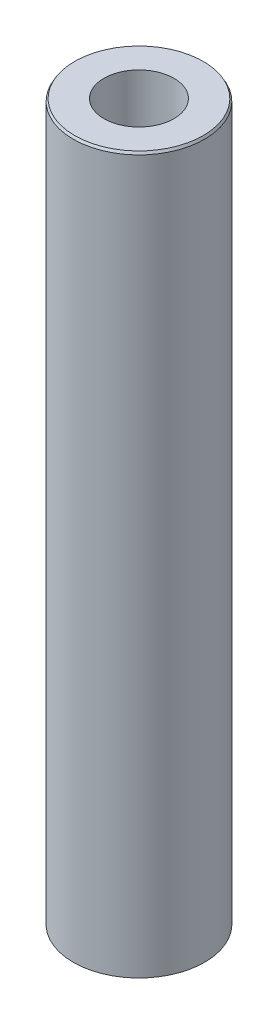
ISO-10303-21;
HEADER;
FILE_DESCRIPTION(('STEP AP214'),'2;1');
FILE_NAME('part.step','',(''),(''),'','','');
FILE_SCHEMA(('AUTOMOTIVE_DESIGN { 1 0 10303 214 1 1 1 1 }'));
ENDSEC;
DATA;
#1=APPLICATION_CONTEXT('core data for automotive mechanical design processes');
#2=APPLICATION_PROTOCOL_DEFINITION('international standard','automotive_design',2000,#1);
#3=PRODUCT_CONTEXT('',#1,'mechanical');
#4=PRODUCT('Part','Part','',(#3));
#5=PRODUCT_RELATED_PRODUCT_CATEGORY('part','',(#4));
#6=PRODUCT_DEFINITION_FORMATION('','',#4);
#7=PRODUCT_DEFINITION_CONTEXT('part definition',#1,'design');
#8=PRODUCT_DEFINITION('design','',#6,#7);
#9=PRODUCT_DEFINITION_SHAPE('','',#8);
#10=(LENGTH_UNIT() NAMED_UNIT(*) SI_UNIT(.MILLI.,.METRE.));
#11=(NAMED_UNIT(*) PLANE_ANGLE_UNIT() SI_UNIT($,.RADIAN.));
#12=(NAMED_UNIT(*) SI_UNIT($,.STERADIAN.) SOLID_ANGLE_UNIT());
#13=UNCERTAINTY_MEASURE_WITH_UNIT(LENGTH_MEASURE(1.E-05),#10,'distance_accuracy_value','');
#14=(GEOMETRIC_REPRESENTATION_CONTEXT(3) GLOBAL_UNCERTAINTY_ASSIGNED_CONTEXT((#13)) GLOBAL_UNIT_ASSIGNED_CONTEXT((#10,
#11,#12)) REPRESENTATION_CONTEXT('',''));
#15=CARTESIAN_POINT('',(0.,0.,0.));
#16=DIRECTION('',(0.,0.,1.));
#17=DIRECTION('',(1.,0.,0.));
#18=AXIS2_PLACEMENT_3D('',#15,#16,#17);
#19=CARTESIAN_POINT('',(0.,600.,0.));
#20=DIRECTION('',(0.,-1.,0.));
#21=DIRECTION('',(0.,0.,-1.));
#22=AXIS2_PLACEMENT_3D('',#19,#20,#21);
#23=CYLINDRICAL_SURFACE('',#22,55.);
#24=CARTESIAN_POINT('',(0.,597.956856890636,0.));
#25=DIRECTION('',(0.,1.,0.));
#26=DIRECTION('',(0.,0.,1.));
#27=AXIS2_PLACEMENT_3D('',#24,#25,#26);
#28=CIRCLE('',#27,55.);
#29=CARTESIAN_POINT('',(0.,597.956856890636,55.));
#30=VERTEX_POINT('',#29);
#31=EDGE_CURVE('E50',#30,#30,#28,.F.);
#32=ORIENTED_EDGE('',*,*,#31,.T.);
#33=EDGE_LOOP('',(#32));
#34=FACE_BOUND('',#33,.T.);
#35=CARTESIAN_POINT('',(0.,1.17960922418425,0.));
#36=DIRECTION('',(0.,1.,0.));
#37=DIRECTION('',(0.,0.,1.));
#38=AXIS2_PLACEMENT_3D('',#35,#36,#37);
#39=CIRCLE('',#38,55.);
#40=CARTESIAN_POINT('',(0.,1.17960922418425,55.));
#41=VERTEX_POINT('',#40);
#42=EDGE_CURVE('E51',#41,#41,#39,.T.);
#43=ORIENTED_EDGE('',*,*,#42,.T.);
#44=EDGE_LOOP('',(#43));
#45=FACE_BOUND('',#44,.T.);
#46=ADVANCED_FACE('F39',(#34,#45),#23,.T.);
#47=CARTESIAN_POINT('',(0.,600.,0.));
#48=DIRECTION('',(0.,1.,0.));
#49=DIRECTION('',(0.,0.,1.));
#50=AXIS2_PLACEMENT_3D('',#47,#48,#49);
#51=PLANE('',#50);
#52=CARTESIAN_POINT('',(0.,600.,0.));
#53=DIRECTION('',(0.,1.,0.));
#54=DIRECTION('',(0.,0.,1.));
#55=AXIS2_PLACEMENT_3D('',#52,#53,#54);
#56=CIRCLE('',#55,53.820390775816);
#57=CARTESIAN_POINT('',(0.,600.,53.820390775816));
#58=VERTEX_POINT('',#57);
#59=EDGE_CURVE('E54',#58,#58,#56,.T.);
#60=ORIENTED_EDGE('',*,*,#59,.T.);
#61=EDGE_LOOP('',(#60));
#62=FACE_BOUND('',#61,.T.);
#63=CARTESIAN_POINT('',(0.,600.,0.));
#64=DIRECTION('',(0.,1.,0.));
#65=DIRECTION('',(0.,0.,1.));
#66=AXIS2_PLACEMENT_3D('',#63,#64,#65);
#67=CIRCLE('',#66,29.3116544775053);
#68=CARTESIAN_POINT('',(0.,600.,29.3116544775053));
#69=VERTEX_POINT('',#68);
#70=EDGE_CURVE('E58',#69,#69,#67,.T.);
#71=ORIENTED_EDGE('',*,*,#70,.F.);
#72=EDGE_LOOP('',(#71));
#73=FACE_BOUND('',#72,.T.);
#74=ADVANCED_FACE('F69',(#62,#73),#51,.T.);
#75=CARTESIAN_POINT('',(0.,0.,0.));
#76=DIRECTION('',(0.,1.,0.));
#77=DIRECTION('',(0.,0.,1.));
#78=AXIS2_PLACEMENT_3D('',#75,#76,#77);
#79=PLANE('',#78);
#80=CARTESIAN_POINT('',(0.,0.,0.));
#81=DIRECTION('',(0.,1.,0.));
#82=DIRECTION('',(0.,0.,1.));
#83=AXIS2_PLACEMENT_3D('',#80,#81,#82);
#84=CIRCLE('',#83,52.956856890636);
#85=CARTESIAN_POINT('',(0.,0.,52.956856890636));
#86=VERTEX_POINT('',#85);
#87=EDGE_CURVE('E10',#86,#86,#84,.F.);
#88=ORIENTED_EDGE('',*,*,#87,.T.);
#89=EDGE_LOOP('',(#88));
#90=FACE_BOUND('',#89,.T.);
#91=CARTESIAN_POINT('',(0.,0.,0.));
#92=DIRECTION('',(0.,1.,0.));
#93=DIRECTION('',(0.,0.,1.));
#94=AXIS2_PLACEMENT_3D('',#91,#92,#93);
#95=CIRCLE('',#94,29.3116544775053);
#96=CARTESIAN_POINT('',(0.,0.,29.3116544775053));
#97=VERTEX_POINT('',#96);
#98=EDGE_CURVE('E63',#97,#97,#95,.T.);
#99=ORIENTED_EDGE('',*,*,#98,.T.);
#100=EDGE_LOOP('',(#99));
#101=FACE_BOUND('',#100,.T.);
#102=ADVANCED_FACE('F75',(#90,#101),#79,.F.);
#103=CARTESIAN_POINT('',(0.,600.,0.));
#104=DIRECTION('',(0.,-1.,0.));
#105=DIRECTION('',(0.,0.,-1.));
#106=AXIS2_PLACEMENT_3D('',#103,#104,#105);
#107=CYLINDRICAL_SURFACE('',#106,29.3116544775053);
#108=ORIENTED_EDGE('',*,*,#70,.T.);
#109=EDGE_LOOP('',(#108));
#110=FACE_BOUND('',#109,.T.);
#111=ORIENTED_EDGE('',*,*,#98,.F.);
#112=EDGE_LOOP('',(#111));
#113=FACE_BOUND('',#112,.T.);
#114=ADVANCED_FACE('F70',(#110,#113),#107,.F.);
#115=CARTESIAN_POINT('',(0.,600.,0.));
#116=DIRECTION('',(0.,-1.,0.));
#117=DIRECTION('',(0.,0.,-1.));
#118=AXIS2_PLACEMENT_3D('',#115,#116,#117);
#119=CONICAL_SURFACE('',#118,53.820390775816,0.523598775598288);
#120=ORIENTED_EDGE('',*,*,#31,.F.);
#121=EDGE_LOOP('',(#120));
#122=FACE_BOUND('',#121,.T.);
#123=ORIENTED_EDGE('',*,*,#59,.F.);
#124=EDGE_LOOP('',(#123));
#125=FACE_BOUND('',#124,.T.);
#126=ADVANCED_FACE('F81',(#122,#125),#119,.T.);
#127=CARTESIAN_POINT('',(0.,1.17960922418425,0.));
#128=DIRECTION('',(0.,1.,0.));
#129=DIRECTION('',(0.,0.,1.));
#130=AXIS2_PLACEMENT_3D('',#127,#128,#129);
#131=CONICAL_SURFACE('',#130,55.,1.04719755119659);
#132=ORIENTED_EDGE('',*,*,#87,.F.);
#133=EDGE_LOOP('',(#132));
#134=FACE_BOUND('',#133,.T.);
#135=ORIENTED_EDGE('',*,*,#42,.F.);
#136=EDGE_LOOP('',(#135));
#137=FACE_BOUND('',#136,.T.);
#138=ADVANCED_FACE('F45',(#134,#137),#131,.T.);
#139=CLOSED_SHELL('',(#46,#74,#102,#114,#126,#138));
#140=MANIFOLD_SOLID_BREP('B2',#139);
#141=ADVANCED_BREP_SHAPE_REPRESENTATION('',(#18,#140),#14);
#142=SHAPE_DEFINITION_REPRESENTATION(#9,#141);
ENDSEC;
END-ISO-10303-21;
